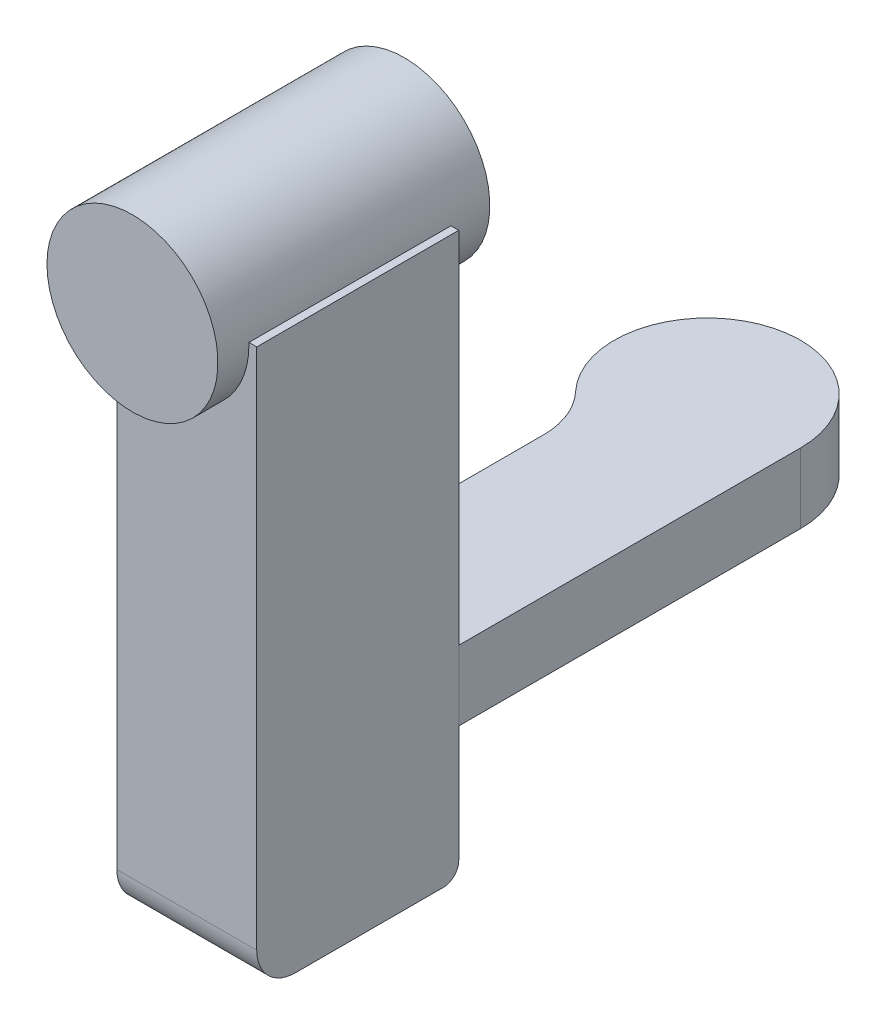
ISO-10303-21;
HEADER;
FILE_DESCRIPTION(('STEP AP214'),'2;1');
FILE_NAME('part.step','',(''),(''),'','','');
FILE_SCHEMA(('AUTOMOTIVE_DESIGN { 1 0 10303 214 1 1 1 1 }'));
ENDSEC;
DATA;
#1=APPLICATION_CONTEXT('core data for automotive mechanical design processes');
#2=APPLICATION_PROTOCOL_DEFINITION('international standard','automotive_design',2000,#1);
#3=PRODUCT_CONTEXT('',#1,'mechanical');
#4=PRODUCT('Part','Part','',(#3));
#5=PRODUCT_RELATED_PRODUCT_CATEGORY('part','',(#4));
#6=PRODUCT_DEFINITION_FORMATION('','',#4);
#7=PRODUCT_DEFINITION_CONTEXT('part definition',#1,'design');
#8=PRODUCT_DEFINITION('design','',#6,#7);
#9=PRODUCT_DEFINITION_SHAPE('','',#8);
#10=(LENGTH_UNIT() NAMED_UNIT(*) SI_UNIT(.MILLI.,.METRE.));
#11=(NAMED_UNIT(*) PLANE_ANGLE_UNIT() SI_UNIT($,.RADIAN.));
#12=(NAMED_UNIT(*) SI_UNIT($,.STERADIAN.) SOLID_ANGLE_UNIT());
#13=UNCERTAINTY_MEASURE_WITH_UNIT(LENGTH_MEASURE(1.E-05),#10,'distance_accuracy_value','');
#14=(GEOMETRIC_REPRESENTATION_CONTEXT(3) GLOBAL_UNCERTAINTY_ASSIGNED_CONTEXT((#13)) GLOBAL_UNIT_ASSIGNED_CONTEXT((#10,
#11,#12)) REPRESENTATION_CONTEXT('',''));
#15=CARTESIAN_POINT('',(0.,0.,0.));
#16=DIRECTION('',(0.,0.,1.));
#17=DIRECTION('',(1.,0.,0.));
#18=AXIS2_PLACEMENT_3D('',#15,#16,#17);
#19=CARTESIAN_POINT('',(0.,-12.,65.));
#20=DIRECTION('',(-1.,0.,0.));
#21=DIRECTION('',(0.,0.,1.));
#22=AXIS2_PLACEMENT_3D('',#19,#20,#21);
#23=CYLINDRICAL_SURFACE('',#22,5.);
#24=DIRECTION('',(-1.,0.,0.));
#25=VECTOR('',#24,1.);
#26=CARTESIAN_POINT('',(0.,-17.,65.));
#27=LINE('',#26,#25);
#28=CARTESIAN_POINT('',(12.,-17.,65.));
#29=VERTEX_POINT('',#28);
#30=CARTESIAN_POINT('',(-5.99999999999999,-17.,65.));
#31=VERTEX_POINT('',#30);
#32=EDGE_CURVE('E148',#29,#31,#27,.T.);
#33=ORIENTED_EDGE('',*,*,#32,.F.);
#34=CARTESIAN_POINT('',(12.,-12.,65.));
#35=DIRECTION('',(1.,0.,0.));
#36=DIRECTION('',(0.,0.,-1.));
#37=AXIS2_PLACEMENT_3D('',#34,#35,#36);
#38=CIRCLE('',#37,5.);
#39=CARTESIAN_POINT('',(12.,-12.,70.));
#40=VERTEX_POINT('',#39);
#41=EDGE_CURVE('E154',#40,#29,#38,.T.);
#42=ORIENTED_EDGE('',*,*,#41,.F.);
#43=DIRECTION('',(-1.,0.,0.));
#44=VECTOR('',#43,1.);
#45=CARTESIAN_POINT('',(12.,-12.,70.));
#46=LINE('',#45,#44);
#47=CARTESIAN_POINT('',(-5.99999999999998,-12.,70.));
#48=VERTEX_POINT('',#47);
#49=EDGE_CURVE('E151',#48,#40,#46,.F.);
#50=ORIENTED_EDGE('',*,*,#49,.F.);
#51=CARTESIAN_POINT('',(-5.99999999999999,-12.,65.));
#52=DIRECTION('',(-1.,0.,0.));
#53=DIRECTION('',(0.,0.,1.));
#54=AXIS2_PLACEMENT_3D('',#51,#52,#53);
#55=CIRCLE('',#54,5.);
#56=EDGE_CURVE('E50',#31,#48,#55,.T.);
#57=ORIENTED_EDGE('',*,*,#56,.F.);
#58=EDGE_LOOP('',(#33,#42,#50,#57));
#59=FACE_BOUND('',#58,.T.);
#60=ADVANCED_FACE('F43',(#59),#23,.T.);
#61=CARTESIAN_POINT('',(12.,-15.,46.));
#62=DIRECTION('',(-1.,0.,0.));
#63=DIRECTION('',(0.,0.,1.));
#64=AXIS2_PLACEMENT_3D('',#61,#62,#63);
#65=CYLINDRICAL_SURFACE('',#64,2.);
#66=DIRECTION('',(-1.,0.,0.));
#67=VECTOR('',#66,1.);
#68=CARTESIAN_POINT('',(12.,-15.,44.));
#69=LINE('',#68,#67);
#70=CARTESIAN_POINT('',(12.,-15.,44.));
#71=VERTEX_POINT('',#70);
#72=CARTESIAN_POINT('',(-5.99999999999999,-15.,44.));
#73=VERTEX_POINT('',#72);
#74=EDGE_CURVE('E135',#71,#73,#69,.T.);
#75=ORIENTED_EDGE('',*,*,#74,.F.);
#76=CARTESIAN_POINT('',(12.,-15.,46.));
#77=DIRECTION('',(1.,0.,0.));
#78=DIRECTION('',(0.,0.,-1.));
#79=AXIS2_PLACEMENT_3D('',#76,#77,#78);
#80=CIRCLE('',#79,2.);
#81=CARTESIAN_POINT('',(12.,-17.,46.));
#82=VERTEX_POINT('',#81);
#83=EDGE_CURVE('E144',#82,#71,#80,.T.);
#84=ORIENTED_EDGE('',*,*,#83,.F.);
#85=DIRECTION('',(-1.,0.,0.));
#86=VECTOR('',#85,1.);
#87=CARTESIAN_POINT('',(0.,-17.,46.));
#88=LINE('',#87,#86);
#89=CARTESIAN_POINT('',(-5.99999999999999,-17.,46.));
#90=VERTEX_POINT('',#89);
#91=EDGE_CURVE('E141',#90,#82,#88,.F.);
#92=ORIENTED_EDGE('',*,*,#91,.F.);
#93=CARTESIAN_POINT('',(-5.99999999999999,-15.,46.));
#94=DIRECTION('',(-1.,0.,0.));
#95=DIRECTION('',(0.,0.,1.));
#96=AXIS2_PLACEMENT_3D('',#93,#94,#95);
#97=CIRCLE('',#96,2.);
#98=EDGE_CURVE('E146',#73,#90,#97,.T.);
#99=ORIENTED_EDGE('',*,*,#98,.F.);
#100=EDGE_LOOP('',(#75,#84,#92,#99));
#101=FACE_BOUND('',#100,.T.);
#102=ADVANCED_FACE('F168',(#101),#65,.T.);
#103=CARTESIAN_POINT('',(12.,-17.,44.));
#104=DIRECTION('',(1.,0.,0.));
#105=DIRECTION('',(0.,0.,-1.));
#106=AXIS2_PLACEMENT_3D('',#103,#104,#105);
#107=PLANE('',#106);
#108=DIRECTION('',(0.,1.,0.));
#109=VECTOR('',#108,1.);
#110=CARTESIAN_POINT('',(12.,-17.,70.));
#111=LINE('',#110,#109);
#112=CARTESIAN_POINT('',(12.,55.2570330123018,70.));
#113=VERTEX_POINT('',#112);
#114=EDGE_CURVE('E132',#40,#113,#111,.T.);
#115=ORIENTED_EDGE('',*,*,#114,.F.);
#116=ORIENTED_EDGE('',*,*,#41,.T.);
#117=DIRECTION('',(0.,0.,-1.));
#118=VECTOR('',#117,1.);
#119=CARTESIAN_POINT('',(12.,-17.,44.));
#120=LINE('',#119,#118);
#121=EDGE_CURVE('E123',#29,#82,#120,.T.);
#122=ORIENTED_EDGE('',*,*,#121,.T.);
#123=ORIENTED_EDGE('',*,*,#83,.T.);
#124=DIRECTION('',(0.,1.,0.));
#125=VECTOR('',#124,1.);
#126=CARTESIAN_POINT('',(12.,-17.,44.));
#127=LINE('',#126,#125);
#128=CARTESIAN_POINT('',(12.,55.2570330123018,44.));
#129=VERTEX_POINT('',#128);
#130=EDGE_CURVE('E131',#71,#129,#127,.T.);
#131=ORIENTED_EDGE('',*,*,#130,.T.);
#132=DIRECTION('',(0.,0.,-1.));
#133=VECTOR('',#132,1.);
#134=CARTESIAN_POINT('',(12.,55.2570330123018,44.));
#135=LINE('',#134,#133);
#136=EDGE_CURVE('E120',#113,#129,#135,.T.);
#137=ORIENTED_EDGE('',*,*,#136,.F.);
#138=EDGE_LOOP('',(#115,#116,#122,#123,#131,#137));
#139=FACE_BOUND('',#138,.T.);
#140=ADVANCED_FACE('F158',(#139),#107,.T.);
#141=CARTESIAN_POINT('',(12.,-17.,70.));
#142=DIRECTION('',(0.,0.,1.));
#143=DIRECTION('',(1.,0.,0.));
#144=AXIS2_PLACEMENT_3D('',#141,#142,#143);
#145=PLANE('',#144);
#146=CARTESIAN_POINT('',(0.,55.,70.));
#147=DIRECTION('',(0.,0.,1.));
#148=DIRECTION('',(1.,0.,0.));
#149=AXIS2_PLACEMENT_3D('',#146,#147,#148);
#150=CIRCLE('',#149,11.);
#151=CARTESIAN_POINT('',(-5.99999999999998,45.7804555427071,70.));
#152=VERTEX_POINT('',#151);
#153=CARTESIAN_POINT('',(10.9969965913693,55.2570330123018,70.));
#154=VERTEX_POINT('',#153);
#155=EDGE_CURVE('E57',#152,#154,#150,.T.);
#156=ORIENTED_EDGE('',*,*,#155,.F.);
#157=DIRECTION('',(0.,1.,0.));
#158=VECTOR('',#157,1.);
#159=CARTESIAN_POINT('',(-5.99999999999998,-17.,70.));
#160=LINE('',#159,#158);
#161=EDGE_CURVE('E136',#48,#152,#160,.T.);
#162=ORIENTED_EDGE('',*,*,#161,.F.);
#163=ORIENTED_EDGE('',*,*,#49,.T.);
#164=ORIENTED_EDGE('',*,*,#114,.T.);
#165=DIRECTION('',(1.,0.,0.));
#166=VECTOR('',#165,1.);
#167=CARTESIAN_POINT('',(12.,55.2570330123018,70.));
#168=LINE('',#167,#166);
#169=EDGE_CURVE('E121',#154,#113,#168,.T.);
#170=ORIENTED_EDGE('',*,*,#169,.F.);
#171=EDGE_LOOP('',(#156,#162,#163,#164,#170));
#172=FACE_BOUND('',#171,.T.);
#173=ADVANCED_FACE('F198',(#172),#145,.T.);
#174=CARTESIAN_POINT('',(-5.99999999999999,-17.,44.));
#175=DIRECTION('',(-1.,0.,0.));
#176=DIRECTION('',(0.,0.,1.));
#177=AXIS2_PLACEMENT_3D('',#174,#175,#176);
#178=PLANE('',#177);
#179=DIRECTION('',(0.,0.,-1.));
#180=VECTOR('',#179,1.);
#181=CARTESIAN_POINT('',(-5.99999999999998,45.7804555427071,74.));
#182=LINE('',#181,#180);
#183=CARTESIAN_POINT('',(-5.99999999999999,45.7804555427071,44.));
#184=VERTEX_POINT('',#183);
#185=EDGE_CURVE('E115',#184,#152,#182,.F.);
#186=ORIENTED_EDGE('',*,*,#185,.F.);
#187=DIRECTION('',(0.,1.,0.));
#188=VECTOR('',#187,1.);
#189=CARTESIAN_POINT('',(-5.99999999999999,-17.,44.));
#190=LINE('',#189,#188);
#191=EDGE_CURVE('E114',#73,#184,#190,.T.);
#192=ORIENTED_EDGE('',*,*,#191,.F.);
#193=ORIENTED_EDGE('',*,*,#98,.T.);
#194=DIRECTION('',(0.,0.,1.));
#195=VECTOR('',#194,1.);
#196=CARTESIAN_POINT('',(-5.99999999999999,-17.,44.));
#197=LINE('',#196,#195);
#198=EDGE_CURVE('E129',#90,#31,#197,.T.);
#199=ORIENTED_EDGE('',*,*,#198,.T.);
#200=ORIENTED_EDGE('',*,*,#56,.T.);
#201=ORIENTED_EDGE('',*,*,#161,.T.);
#202=EDGE_LOOP('',(#186,#192,#193,#199,#200,#201));
#203=FACE_BOUND('',#202,.T.);
#204=ADVANCED_FACE('F169',(#203),#178,.T.);
#205=CARTESIAN_POINT('',(12.,-17.,44.));
#206=DIRECTION('',(0.,0.,-1.));
#207=DIRECTION('',(-1.,0.,0.));
#208=AXIS2_PLACEMENT_3D('',#205,#206,#207);
#209=PLANE('',#208);
#210=CARTESIAN_POINT('',(0.,55.,44.));
#211=DIRECTION('',(0.,0.,-1.));
#212=DIRECTION('',(-1.,0.,0.));
#213=AXIS2_PLACEMENT_3D('',#210,#211,#212);
#214=CIRCLE('',#213,11.);
#215=CARTESIAN_POINT('',(10.9969965913693,55.2570330123018,44.));
#216=VERTEX_POINT('',#215);
#217=EDGE_CURVE('E100',#216,#184,#214,.T.);
#218=ORIENTED_EDGE('',*,*,#217,.F.);
#219=DIRECTION('',(-1.,0.,0.));
#220=VECTOR('',#219,1.);
#221=CARTESIAN_POINT('',(12.,55.2570330123018,44.));
#222=LINE('',#221,#220);
#223=EDGE_CURVE('E110',#129,#216,#222,.T.);
#224=ORIENTED_EDGE('',*,*,#223,.F.);
#225=ORIENTED_EDGE('',*,*,#130,.F.);
#226=ORIENTED_EDGE('',*,*,#74,.T.);
#227=ORIENTED_EDGE('',*,*,#191,.T.);
#228=EDGE_LOOP('',(#218,#224,#225,#226,#227));
#229=FACE_BOUND('',#228,.T.);
#230=ADVANCED_FACE('F108',(#229),#209,.T.);
#231=CARTESIAN_POINT('',(0.,-17.,0.));
#232=DIRECTION('',(0.,-1.,0.));
#233=DIRECTION('',(0.,0.,-1.));
#234=AXIS2_PLACEMENT_3D('',#231,#232,#233);
#235=PLANE('',#234);
#236=ORIENTED_EDGE('',*,*,#121,.F.);
#237=ORIENTED_EDGE('',*,*,#32,.T.);
#238=ORIENTED_EDGE('',*,*,#198,.F.);
#239=ORIENTED_EDGE('',*,*,#91,.T.);
#240=EDGE_LOOP('',(#236,#237,#238,#239));
#241=FACE_BOUND('',#240,.T.);
#242=ADVANCED_FACE('F164',(#241),#235,.T.);
#243=CARTESIAN_POINT('',(0.,55.2570330123018,0.));
#244=DIRECTION('',(0.,-1.,0.));
#245=DIRECTION('',(0.,0.,-1.));
#246=AXIS2_PLACEMENT_3D('',#243,#244,#245);
#247=PLANE('',#246);
#248=ORIENTED_EDGE('',*,*,#223,.T.);
#249=DIRECTION('',(0.,0.,-1.));
#250=VECTOR('',#249,1.);
#251=CARTESIAN_POINT('',(10.9969965913693,55.2570330123018,74.));
#252=LINE('',#251,#250);
#253=EDGE_CURVE('E12',#216,#154,#252,.F.);
#254=ORIENTED_EDGE('',*,*,#253,.T.);
#255=ORIENTED_EDGE('',*,*,#169,.T.);
#256=ORIENTED_EDGE('',*,*,#136,.T.);
#257=EDGE_LOOP('',(#248,#254,#255,#256));
#258=FACE_BOUND('',#257,.T.);
#259=ADVANCED_FACE('F118',(#258),#247,.F.);
#260=CARTESIAN_POINT('',(0.,55.,74.));
#261=DIRECTION('',(0.,0.,-1.));
#262=DIRECTION('',(-1.,0.,0.));
#263=AXIS2_PLACEMENT_3D('',#260,#261,#262);
#264=CYLINDRICAL_SURFACE('',#263,11.);
#265=ORIENTED_EDGE('',*,*,#185,.T.);
#266=ORIENTED_EDGE('',*,*,#155,.T.);
#267=ORIENTED_EDGE('',*,*,#253,.F.);
#268=ORIENTED_EDGE('',*,*,#217,.T.);
#269=EDGE_LOOP('',(#265,#266,#267,#268));
#270=FACE_BOUND('',#269,.T.);
#271=CARTESIAN_POINT('',(0.,55.,74.));
#272=DIRECTION('',(0.,0.,-1.));
#273=DIRECTION('',(-1.,0.,0.));
#274=AXIS2_PLACEMENT_3D('',#271,#272,#273);
#275=CIRCLE('',#274,11.);
#276=CARTESIAN_POINT('',(-11.,55.,74.));
#277=VERTEX_POINT('',#276);
#278=EDGE_CURVE('E116',#277,#277,#275,.T.);
#279=ORIENTED_EDGE('',*,*,#278,.T.);
#280=EDGE_LOOP('',(#279));
#281=FACE_BOUND('',#280,.T.);
#282=CARTESIAN_POINT('',(0.,55.,39.));
#283=DIRECTION('',(0.,0.,-1.));
#284=DIRECTION('',(-1.,0.,0.));
#285=AXIS2_PLACEMENT_3D('',#282,#283,#284);
#286=CIRCLE('',#285,11.);
#287=CARTESIAN_POINT('',(-11.,55.,39.));
#288=VERTEX_POINT('',#287);
#289=EDGE_CURVE('E175',#288,#288,#286,.T.);
#290=ORIENTED_EDGE('',*,*,#289,.F.);
#291=EDGE_LOOP('',(#290));
#292=FACE_BOUND('',#291,.T.);
#293=ADVANCED_FACE('F98',(#270,#281,#292),#264,.T.);
#294=CARTESIAN_POINT('',(0.,55.,74.));
#295=DIRECTION('',(0.,0.,-1.));
#296=DIRECTION('',(-1.,0.,0.));
#297=AXIS2_PLACEMENT_3D('',#294,#295,#296);
#298=PLANE('',#297);
#299=ORIENTED_EDGE('',*,*,#278,.F.);
#300=EDGE_LOOP('',(#299));
#301=FACE_BOUND('',#300,.T.);
#302=ADVANCED_FACE('F182',(#301),#298,.F.);
#303=CARTESIAN_POINT('',(0.,55.,39.));
#304=DIRECTION('',(0.,0.,-1.));
#305=DIRECTION('',(-1.,0.,0.));
#306=AXIS2_PLACEMENT_3D('',#303,#304,#305);
#307=PLANE('',#306);
#308=ORIENTED_EDGE('',*,*,#289,.T.);
#309=EDGE_LOOP('',(#308));
#310=FACE_BOUND('',#309,.T.);
#311=ADVANCED_FACE('F179',(#310),#307,.T.);
#312=CLOSED_SHELL('',(#60,#102,#140,#173,#204,#230,#242,#259,#293,#302,#311));
#313=MANIFOLD_SOLID_BREP('B2',#312);
#314=CARTESIAN_POINT('',(-16.,9.,15.0996688705415));
#315=DIRECTION('',(0.,-1.,0.));
#316=DIRECTION('',(0.,0.,-1.));
#317=AXIS2_PLACEMENT_3D('',#314,#315,#316);
#318=CYLINDRICAL_SURFACE('',#317,10.);
#319=CARTESIAN_POINT('',(-16.,0.,15.0996688705415));
#320=DIRECTION('',(0.,-1.,0.));
#321=DIRECTION('',(0.,0.,1.));
#322=AXIS2_PLACEMENT_3D('',#319,#320,#321);
#323=CIRCLE('',#322,10.);
#324=CARTESIAN_POINT('',(-8.72727272727273,0.,8.23618302029537));
#325=VERTEX_POINT('',#324);
#326=CARTESIAN_POINT('',(-5.99999999999999,0.,15.0996688705415));
#327=VERTEX_POINT('',#326);
#328=EDGE_CURVE('E349',#325,#327,#323,.T.);
#329=ORIENTED_EDGE('',*,*,#328,.T.);
#330=DIRECTION('',(0.,-1.,0.));
#331=VECTOR('',#330,1.);
#332=CARTESIAN_POINT('',(-5.99999999999999,9.,15.0996688705415));
#333=LINE('',#332,#331);
#334=CARTESIAN_POINT('',(-5.99999999999999,9.,15.0996688705415));
#335=VERTEX_POINT('',#334);
#336=EDGE_CURVE('E41',#335,#327,#333,.T.);
#337=ORIENTED_EDGE('',*,*,#336,.F.);
#338=CARTESIAN_POINT('',(-16.,9.,15.0996688705415));
#339=DIRECTION('',(0.,-1.,0.));
#340=DIRECTION('',(0.,0.,1.));
#341=AXIS2_PLACEMENT_3D('',#338,#339,#340);
#342=CIRCLE('',#341,10.);
#343=CARTESIAN_POINT('',(-8.72727272727273,9.,8.23618302029537));
#344=VERTEX_POINT('',#343);
#345=EDGE_CURVE('E357',#344,#335,#342,.T.);
#346=ORIENTED_EDGE('',*,*,#345,.F.);
#347=DIRECTION('',(0.,-1.,0.));
#348=VECTOR('',#347,1.);
#349=CARTESIAN_POINT('',(-8.72727272727273,9.,8.23618302029537));
#350=LINE('',#349,#348);
#351=EDGE_CURVE('E345',#344,#325,#350,.T.);
#352=ORIENTED_EDGE('',*,*,#351,.T.);
#353=EDGE_LOOP('',(#329,#337,#346,#352));
#354=FACE_BOUND('',#353,.T.);
#355=ADVANCED_FACE('F275',(#354),#318,.F.);
#356=CARTESIAN_POINT('',(-5.99999999999999,9.,44.));
#357=DIRECTION('',(1.,0.,0.));
#358=DIRECTION('',(0.,0.,-1.));
#359=AXIS2_PLACEMENT_3D('',#356,#357,#358);
#360=PLANE('',#359);
#361=DIRECTION('',(0.,0.,1.));
#362=VECTOR('',#361,1.);
#363=CARTESIAN_POINT('',(-5.99999999999999,0.,44.));
#364=LINE('',#363,#362);
#365=CARTESIAN_POINT('',(-5.99999999999999,0.,44.));
#366=VERTEX_POINT('',#365);
#367=EDGE_CURVE('E352',#327,#366,#364,.T.);
#368=ORIENTED_EDGE('',*,*,#367,.T.);
#369=DIRECTION('',(0.,-1.,0.));
#370=VECTOR('',#369,1.);
#371=CARTESIAN_POINT('',(-5.99999999999999,9.,44.));
#372=LINE('',#371,#370);
#373=CARTESIAN_POINT('',(-5.99999999999999,9.,44.));
#374=VERTEX_POINT('',#373);
#375=EDGE_CURVE('E283',#374,#366,#372,.T.);
#376=ORIENTED_EDGE('',*,*,#375,.F.);
#377=DIRECTION('',(0.,0.,1.));
#378=VECTOR('',#377,1.);
#379=CARTESIAN_POINT('',(-5.99999999999999,9.,44.));
#380=LINE('',#379,#378);
#381=EDGE_CURVE('E325',#335,#374,#380,.T.);
#382=ORIENTED_EDGE('',*,*,#381,.F.);
#383=ORIENTED_EDGE('',*,*,#336,.T.);
#384=EDGE_LOOP('',(#368,#376,#382,#383));
#385=FACE_BOUND('',#384,.T.);
#386=ADVANCED_FACE('F376',(#385),#360,.F.);
#387=CARTESIAN_POINT('',(12.,9.,44.));
#388=DIRECTION('',(0.,0.,-1.));
#389=DIRECTION('',(-1.,0.,0.));
#390=AXIS2_PLACEMENT_3D('',#387,#388,#389);
#391=PLANE('',#390);
#392=DIRECTION('',(1.,0.,0.));
#393=VECTOR('',#392,1.);
#394=CARTESIAN_POINT('',(12.,0.,44.));
#395=LINE('',#394,#393);
#396=CARTESIAN_POINT('',(12.,0.,44.));
#397=VERTEX_POINT('',#396);
#398=EDGE_CURVE('E340',#366,#397,#395,.T.);
#399=ORIENTED_EDGE('',*,*,#398,.T.);
#400=DIRECTION('',(0.,-1.,0.));
#401=VECTOR('',#400,1.);
#402=CARTESIAN_POINT('',(12.,9.,44.));
#403=LINE('',#402,#401);
#404=CARTESIAN_POINT('',(12.,9.,44.));
#405=VERTEX_POINT('',#404);
#406=EDGE_CURVE('E337',#405,#397,#403,.T.);
#407=ORIENTED_EDGE('',*,*,#406,.F.);
#408=DIRECTION('',(1.,0.,0.));
#409=VECTOR('',#408,1.);
#410=CARTESIAN_POINT('',(12.,9.,44.));
#411=LINE('',#410,#409);
#412=EDGE_CURVE('E329',#374,#405,#411,.T.);
#413=ORIENTED_EDGE('',*,*,#412,.F.);
#414=ORIENTED_EDGE('',*,*,#375,.T.);
#415=EDGE_LOOP('',(#399,#407,#413,#414));
#416=FACE_BOUND('',#415,.T.);
#417=ADVANCED_FACE('F338',(#416),#391,.F.);
#418=CARTESIAN_POINT('',(12.,9.,0.));
#419=DIRECTION('',(-1.,0.,0.));
#420=DIRECTION('',(0.,0.,1.));
#421=AXIS2_PLACEMENT_3D('',#418,#419,#420);
#422=PLANE('',#421);
#423=DIRECTION('',(0.,0.,-1.));
#424=VECTOR('',#423,1.);
#425=CARTESIAN_POINT('',(12.,0.,0.));
#426=LINE('',#425,#424);
#427=CARTESIAN_POINT('',(12.,0.,0.));
#428=VERTEX_POINT('',#427);
#429=EDGE_CURVE('E311',#397,#428,#426,.T.);
#430=ORIENTED_EDGE('',*,*,#429,.T.);
#431=DIRECTION('',(0.,-1.,0.));
#432=VECTOR('',#431,1.);
#433=CARTESIAN_POINT('',(12.,9.,0.));
#434=LINE('',#433,#432);
#435=CARTESIAN_POINT('',(12.,9.,0.));
#436=VERTEX_POINT('',#435);
#437=EDGE_CURVE('E341',#436,#428,#434,.T.);
#438=ORIENTED_EDGE('',*,*,#437,.F.);
#439=DIRECTION('',(0.,0.,-1.));
#440=VECTOR('',#439,1.);
#441=CARTESIAN_POINT('',(12.,9.,0.));
#442=LINE('',#441,#440);
#443=EDGE_CURVE('E333',#405,#436,#442,.T.);
#444=ORIENTED_EDGE('',*,*,#443,.F.);
#445=ORIENTED_EDGE('',*,*,#406,.T.);
#446=EDGE_LOOP('',(#430,#438,#444,#445));
#447=FACE_BOUND('',#446,.T.);
#448=ADVANCED_FACE('F343',(#447),#422,.F.);
#449=CARTESIAN_POINT('',(0.,9.,0.));
#450=DIRECTION('',(0.,-1.,0.));
#451=DIRECTION('',(0.,0.,-1.));
#452=AXIS2_PLACEMENT_3D('',#449,#450,#451);
#453=CYLINDRICAL_SURFACE('',#452,12.);
#454=CARTESIAN_POINT('',(0.,0.,0.));
#455=DIRECTION('',(0.,1.,0.));
#456=DIRECTION('',(0.,0.,1.));
#457=AXIS2_PLACEMENT_3D('',#454,#455,#456);
#458=CIRCLE('',#457,12.);
#459=EDGE_CURVE('E317',#428,#325,#458,.T.);
#460=ORIENTED_EDGE('',*,*,#459,.T.);
#461=ORIENTED_EDGE('',*,*,#351,.F.);
#462=CARTESIAN_POINT('',(0.,9.,0.));
#463=DIRECTION('',(0.,1.,0.));
#464=DIRECTION('',(0.,0.,1.));
#465=AXIS2_PLACEMENT_3D('',#462,#463,#464);
#466=CIRCLE('',#465,12.);
#467=EDGE_CURVE('E291',#436,#344,#466,.T.);
#468=ORIENTED_EDGE('',*,*,#467,.F.);
#469=ORIENTED_EDGE('',*,*,#437,.T.);
#470=EDGE_LOOP('',(#460,#461,#468,#469));
#471=FACE_BOUND('',#470,.T.);
#472=ADVANCED_FACE('F365',(#471),#453,.T.);
#473=CARTESIAN_POINT('',(-16.,9.,15.0996688705415));
#474=DIRECTION('',(0.,1.,0.));
#475=DIRECTION('',(0.,0.,1.));
#476=AXIS2_PLACEMENT_3D('',#473,#474,#475);
#477=PLANE('',#476);
#478=ORIENTED_EDGE('',*,*,#345,.T.);
#479=ORIENTED_EDGE('',*,*,#381,.T.);
#480=ORIENTED_EDGE('',*,*,#412,.T.);
#481=ORIENTED_EDGE('',*,*,#443,.T.);
#482=ORIENTED_EDGE('',*,*,#467,.T.);
#483=EDGE_LOOP('',(#478,#479,#480,#481,#482));
#484=FACE_BOUND('',#483,.T.);
#485=ADVANCED_FACE('F331',(#484),#477,.T.);
#486=CARTESIAN_POINT('',(-16.,0.,15.0996688705415));
#487=DIRECTION('',(0.,1.,0.));
#488=DIRECTION('',(0.,0.,1.));
#489=AXIS2_PLACEMENT_3D('',#486,#487,#488);
#490=PLANE('',#489);
#491=ORIENTED_EDGE('',*,*,#328,.F.);
#492=ORIENTED_EDGE('',*,*,#459,.F.);
#493=ORIENTED_EDGE('',*,*,#429,.F.);
#494=ORIENTED_EDGE('',*,*,#398,.F.);
#495=ORIENTED_EDGE('',*,*,#367,.F.);
#496=EDGE_LOOP('',(#491,#492,#493,#494,#495));
#497=FACE_BOUND('',#496,.T.);
#498=ADVANCED_FACE('F361',(#497),#490,.F.);
#499=CLOSED_SHELL('',(#355,#386,#417,#448,#472,#485,#498));
#500=MANIFOLD_SOLID_BREP('B6',#499);
#501=ADVANCED_BREP_SHAPE_REPRESENTATION('',(#18,#313,#500),#14);
#502=SHAPE_DEFINITION_REPRESENTATION(#9,#501);
ENDSEC;
END-ISO-10303-21;
